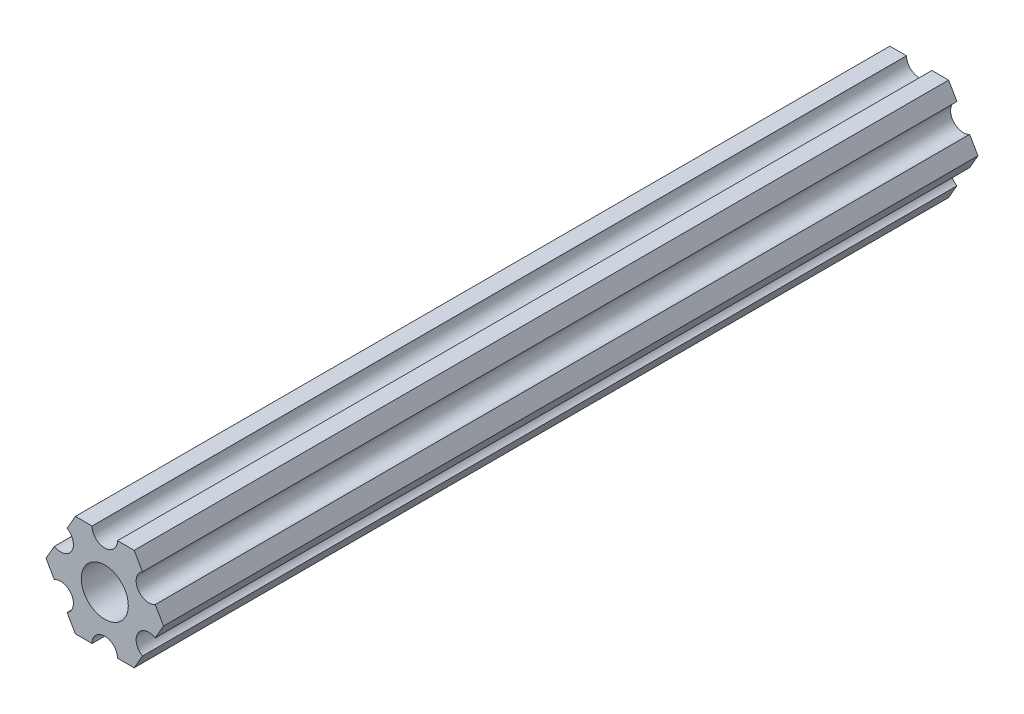
ISO-10303-21;
HEADER;
FILE_DESCRIPTION(('STEP AP214'),'2;1');
FILE_NAME('part.step','',(''),(''),'','','');
FILE_SCHEMA(('AUTOMOTIVE_DESIGN { 1 0 10303 214 1 1 1 1 }'));
ENDSEC;
DATA;
#1=APPLICATION_CONTEXT('core data for automotive mechanical design processes');
#2=APPLICATION_PROTOCOL_DEFINITION('international standard','automotive_design',2000,#1);
#3=PRODUCT_CONTEXT('',#1,'mechanical');
#4=PRODUCT('Part','Part','',(#3));
#5=PRODUCT_RELATED_PRODUCT_CATEGORY('part','',(#4));
#6=PRODUCT_DEFINITION_FORMATION('','',#4);
#7=PRODUCT_DEFINITION_CONTEXT('part definition',#1,'design');
#8=PRODUCT_DEFINITION('design','',#6,#7);
#9=PRODUCT_DEFINITION_SHAPE('','',#8);
#10=(LENGTH_UNIT() NAMED_UNIT(*) SI_UNIT(.MILLI.,.METRE.));
#11=(NAMED_UNIT(*) PLANE_ANGLE_UNIT() SI_UNIT($,.RADIAN.));
#12=(NAMED_UNIT(*) SI_UNIT($,.STERADIAN.) SOLID_ANGLE_UNIT());
#13=UNCERTAINTY_MEASURE_WITH_UNIT(LENGTH_MEASURE(1.E-05),#10,'distance_accuracy_value','');
#14=(GEOMETRIC_REPRESENTATION_CONTEXT(3) GLOBAL_UNCERTAINTY_ASSIGNED_CONTEXT((#13)) GLOBAL_UNIT_ASSIGNED_CONTEXT((#10,
#11,#12)) REPRESENTATION_CONTEXT('',''));
#15=CARTESIAN_POINT('',(0.,0.,0.));
#16=DIRECTION('',(0.,0.,1.));
#17=DIRECTION('',(1.,0.,0.));
#18=AXIS2_PLACEMENT_3D('',#15,#16,#17);
#19=CARTESIAN_POINT('',(5.49926112168156,3.17500033315933,101.6));
#20=DIRECTION('',(0.,0.,1.));
#21=DIRECTION('',(1.,0.,0.));
#22=AXIS2_PLACEMENT_3D('',#19,#20,#21);
#23=PLANE('',#22);
#24=DIRECTION('',(0.499999947533953,0.866025434075723,0.));
#25=VECTOR('',#24,1.);
#26=CARTESIAN_POINT('',(6.29301142309098,-1.80018429024546,101.6));
#27=LINE('',#26,#25);
#28=CARTESIAN_POINT('',(6.29301142309098,-1.80018429024546,101.6));
#29=VERTEX_POINT('',#28);
#30=CARTESIAN_POINT('',(7.33234841870826,4.44212519169686E-07,101.6));
#31=VERTEX_POINT('',#30);
#32=EDGE_CURVE('E227',#29,#31,#27,.T.);
#33=ORIENTED_EDGE('',*,*,#32,.T.);
#34=DIRECTION('',(-0.500000052466056,0.866025373493145,0.));
#35=VECTOR('',#34,1.);
#36=CARTESIAN_POINT('',(7.33234841870826,4.44212519169686E-07,101.6));
#37=LINE('',#36,#35);
#38=CARTESIAN_POINT('',(6.29301120497139,1.80018505273894,101.6));
#39=VERTEX_POINT('',#38);
#40=EDGE_CURVE('E125',#31,#39,#37,.T.);
#41=ORIENTED_EDGE('',*,*,#40,.T.);
#42=CARTESIAN_POINT('',(5.49926112168156,3.17500033315933,101.6));
#43=DIRECTION('',(0.,0.,-1.));
#44=DIRECTION('',(1.,0.,0.));
#45=AXIS2_PLACEMENT_3D('',#42,#43,#44);
#46=CIRCLE('',#45,1.5875);
#47=CARTESIAN_POINT('',(4.70551103839172,4.54981561357972,101.6));
#48=VERTEX_POINT('',#47);
#49=EDGE_CURVE('E272',#39,#48,#46,.T.);
#50=ORIENTED_EDGE('',*,*,#49,.T.);
#51=DIRECTION('',(-0.500000052466046,0.866025373493151,0.));
#52=VECTOR('',#51,1.);
#53=CARTESIAN_POINT('',(4.70551103839172,4.54981561357972,101.6));
#54=LINE('',#53,#52);
#55=CARTESIAN_POINT('',(3.66617382465481,6.35000022210627,101.6));
#56=VERTEX_POINT('',#55);
#57=EDGE_CURVE('E291',#48,#56,#54,.T.);
#58=ORIENTED_EDGE('',*,*,#57,.T.);
#59=DIRECTION('',(-0.999999999999998,-6.05825850611185E-08,0.));
#60=VECTOR('',#59,1.);
#61=CARTESIAN_POINT('',(3.66617382465481,6.35000022210627,101.6));
#62=LINE('',#61,#60);
#63=CARTESIAN_POINT('',(1.58749961530074,6.35000009617482,101.6));
#64=VERTEX_POINT('',#63);
#65=EDGE_CURVE('E288',#56,#64,#62,.T.);
#66=ORIENTED_EDGE('',*,*,#65,.T.);
#67=CARTESIAN_POINT('',(-3.84699260060323E-07,6.35,101.6));
#68=DIRECTION('',(0.,0.,-1.));
#69=DIRECTION('',(1.,0.,0.));
#70=AXIS2_PLACEMENT_3D('',#67,#68,#69);
#71=CIRCLE('',#70,1.5875);
#72=CARTESIAN_POINT('',(-1.58750038469926,6.34999990382518,101.6));
#73=VERTEX_POINT('',#72);
#74=EDGE_CURVE('E290',#64,#73,#71,.T.);
#75=ORIENTED_EDGE('',*,*,#74,.T.);
#76=DIRECTION('',(-0.999999999999998,-6.05825963273174E-08,0.));
#77=VECTOR('',#76,1.);
#78=CARTESIAN_POINT('',(-1.58750038469926,6.34999990382518,101.6));
#79=LINE('',#78,#77);
#80=CARTESIAN_POINT('',(-3.66617459405349,6.3499997778937,101.6));
#81=VERTEX_POINT('',#80);
#82=EDGE_CURVE('E293',#73,#81,#79,.T.);
#83=ORIENTED_EDGE('',*,*,#82,.T.);
#84=DIRECTION('',(-0.499999947533942,-0.866025434075729,0.));
#85=VECTOR('',#84,1.);
#86=CARTESIAN_POINT('',(-3.66617459405349,6.3499997778937,101.6));
#87=LINE('',#86,#85);
#88=CARTESIAN_POINT('',(-4.70551158967065,4.54981504343587,101.6));
#89=VERTEX_POINT('',#88);
#90=EDGE_CURVE('E299',#81,#89,#87,.T.);
#91=ORIENTED_EDGE('',*,*,#90,.T.);
#92=CARTESIAN_POINT('',(-5.49926150638082,3.17499966684067,101.6));
#93=DIRECTION('',(0.,0.,-1.));
#94=DIRECTION('',(1.,0.,0.));
#95=AXIS2_PLACEMENT_3D('',#92,#93,#94);
#96=CIRCLE('',#95,1.5875);
#97=CARTESIAN_POINT('',(-6.29301142309098,1.80018429024547,101.6));
#98=VERTEX_POINT('',#97);
#99=EDGE_CURVE('E301',#89,#98,#96,.T.);
#100=ORIENTED_EDGE('',*,*,#99,.T.);
#101=DIRECTION('',(-0.499999947533951,-0.866025434075724,0.));
#102=VECTOR('',#101,1.);
#103=CARTESIAN_POINT('',(-6.29301142309098,1.80018429024547,101.6));
#104=LINE('',#103,#102);
#105=CARTESIAN_POINT('',(-7.33234841870826,-4.44212523790841E-07,101.6));
#106=VERTEX_POINT('',#105);
#107=EDGE_CURVE('E303',#98,#106,#104,.T.);
#108=ORIENTED_EDGE('',*,*,#107,.T.);
#109=DIRECTION('',(0.500000052466045,-0.866025373493151,0.));
#110=VECTOR('',#109,1.);
#111=CARTESIAN_POINT('',(-7.33234841870826,-4.44212523790841E-07,101.6));
#112=LINE('',#111,#110);
#113=CARTESIAN_POINT('',(-6.29301120497141,-1.80018505273897,101.6));
#114=VERTEX_POINT('',#113);
#115=EDGE_CURVE('E305',#106,#114,#112,.T.);
#116=ORIENTED_EDGE('',*,*,#115,.T.);
#117=CARTESIAN_POINT('',(-5.49926112168156,-3.17500033315934,101.6));
#118=DIRECTION('',(0.,0.,-1.));
#119=DIRECTION('',(1.,0.,0.));
#120=AXIS2_PLACEMENT_3D('',#117,#118,#119);
#121=CIRCLE('',#120,1.5875);
#122=CARTESIAN_POINT('',(-4.70551103839172,-4.54981561357972,101.6));
#123=VERTEX_POINT('',#122);
#124=EDGE_CURVE('E307',#114,#123,#121,.T.);
#125=ORIENTED_EDGE('',*,*,#124,.T.);
#126=DIRECTION('',(0.500000052466045,-0.866025373493151,0.));
#127=VECTOR('',#126,1.);
#128=CARTESIAN_POINT('',(-4.70551103839172,-4.54981561357972,101.6));
#129=LINE('',#128,#127);
#130=CARTESIAN_POINT('',(-3.66617382465481,-6.35000022210628,101.6));
#131=VERTEX_POINT('',#130);
#132=EDGE_CURVE('E309',#123,#131,#129,.T.);
#133=ORIENTED_EDGE('',*,*,#132,.T.);
#134=DIRECTION('',(0.999999999999998,6.05825854783851E-08,0.));
#135=VECTOR('',#134,1.);
#136=CARTESIAN_POINT('',(-3.66617382465481,-6.35000022210628,101.6));
#137=LINE('',#136,#135);
#138=CARTESIAN_POINT('',(-1.58749961530074,-6.35000009617482,101.6));
#139=VERTEX_POINT('',#138);
#140=EDGE_CURVE('E311',#131,#139,#137,.T.);
#141=ORIENTED_EDGE('',*,*,#140,.T.);
#142=CARTESIAN_POINT('',(3.8469926204343E-07,-6.35,101.6));
#143=DIRECTION('',(0.,0.,-1.));
#144=DIRECTION('',(1.,0.,0.));
#145=AXIS2_PLACEMENT_3D('',#142,#143,#144);
#146=CIRCLE('',#145,1.5875);
#147=CARTESIAN_POINT('',(1.58750038469926,-6.34999990382518,101.6));
#148=VERTEX_POINT('',#147);
#149=EDGE_CURVE('E174',#139,#148,#146,.T.);
#150=ORIENTED_EDGE('',*,*,#149,.T.);
#151=DIRECTION('',(0.999999999999998,6.05825721258438E-08,0.));
#152=VECTOR('',#151,1.);
#153=CARTESIAN_POINT('',(1.58750038469926,-6.34999990382518,101.6));
#154=LINE('',#153,#152);
#155=CARTESIAN_POINT('',(3.66617459405346,-6.34999977789375,101.6));
#156=VERTEX_POINT('',#155);
#157=EDGE_CURVE('E168',#148,#156,#154,.T.);
#158=ORIENTED_EDGE('',*,*,#157,.T.);
#159=DIRECTION('',(0.499999947533941,0.86602543407573,0.));
#160=VECTOR('',#159,1.);
#161=CARTESIAN_POINT('',(3.66617459405346,-6.34999977789375,101.6));
#162=LINE('',#161,#160);
#163=CARTESIAN_POINT('',(4.70551158967065,-4.54981504343587,101.6));
#164=VERTEX_POINT('',#163);
#165=EDGE_CURVE('E172',#156,#164,#162,.T.);
#166=ORIENTED_EDGE('',*,*,#165,.T.);
#167=CARTESIAN_POINT('',(5.49926150638082,-3.17499966684067,101.6));
#168=DIRECTION('',(0.,0.,-1.));
#169=DIRECTION('',(1.,0.,0.));
#170=AXIS2_PLACEMENT_3D('',#167,#168,#169);
#171=CIRCLE('',#170,1.58750000000001);
#172=EDGE_CURVE('E52',#164,#29,#171,.T.);
#173=ORIENTED_EDGE('',*,*,#172,.T.);
#174=EDGE_LOOP('',(#33,#41,#50,#58,#66,#75,#83,#91,#100,#108,#116,#125,#133,#141,#150,#158,#166,#173));
#175=FACE_BOUND('',#174,.T.);
#176=CARTESIAN_POINT('',(0.,0.,101.6));
#177=DIRECTION('',(0.,0.,1.));
#178=DIRECTION('',(1.,0.,0.));
#179=AXIS2_PLACEMENT_3D('',#176,#177,#178);
#180=CIRCLE('',#179,2.9337);
#181=CARTESIAN_POINT('',(2.9337,0.,101.6));
#182=VERTEX_POINT('',#181);
#183=EDGE_CURVE('E196',#182,#182,#180,.T.);
#184=ORIENTED_EDGE('',*,*,#183,.F.);
#185=EDGE_LOOP('',(#184));
#186=FACE_BOUND('',#185,.T.);
#187=ADVANCED_FACE('F35',(#175,#186),#23,.T.);
#188=CARTESIAN_POINT('',(5.49926112168156,3.17500033315933,0.));
#189=DIRECTION('',(0.,0.,1.));
#190=DIRECTION('',(1.,0.,0.));
#191=AXIS2_PLACEMENT_3D('',#188,#189,#190);
#192=PLANE('',#191);
#193=DIRECTION('',(0.499999947533953,0.866025434075723,0.));
#194=VECTOR('',#193,1.);
#195=CARTESIAN_POINT('',(6.29301142309098,-1.80018429024546,0.));
#196=LINE('',#195,#194);
#197=CARTESIAN_POINT('',(6.29301142309098,-1.80018429024546,0.));
#198=VERTEX_POINT('',#197);
#199=CARTESIAN_POINT('',(7.33234841870826,4.44212519169686E-07,0.));
#200=VERTEX_POINT('',#199);
#201=EDGE_CURVE('E192',#198,#200,#196,.T.);
#202=ORIENTED_EDGE('',*,*,#201,.F.);
#203=CARTESIAN_POINT('',(5.49926150638082,-3.17499966684067,0.));
#204=DIRECTION('',(0.,0.,-1.));
#205=DIRECTION('',(1.,0.,0.));
#206=AXIS2_PLACEMENT_3D('',#203,#204,#205);
#207=CIRCLE('',#206,1.58750000000001);
#208=CARTESIAN_POINT('',(4.70551158967065,-4.54981504343587,0.));
#209=VERTEX_POINT('',#208);
#210=EDGE_CURVE('E117',#209,#198,#207,.T.);
#211=ORIENTED_EDGE('',*,*,#210,.F.);
#212=DIRECTION('',(0.499999947533941,0.86602543407573,0.));
#213=VECTOR('',#212,1.);
#214=CARTESIAN_POINT('',(3.66617459405346,-6.34999977789375,0.));
#215=LINE('',#214,#213);
#216=CARTESIAN_POINT('',(3.66617459405346,-6.34999977789375,0.));
#217=VERTEX_POINT('',#216);
#218=EDGE_CURVE('E111',#217,#209,#215,.T.);
#219=ORIENTED_EDGE('',*,*,#218,.F.);
#220=DIRECTION('',(0.999999999999998,6.05825721258438E-08,0.));
#221=VECTOR('',#220,1.);
#222=CARTESIAN_POINT('',(1.58750038469926,-6.34999990382518,0.));
#223=LINE('',#222,#221);
#224=CARTESIAN_POINT('',(1.58750038469926,-6.34999990382518,0.));
#225=VERTEX_POINT('',#224);
#226=EDGE_CURVE('E182',#225,#217,#223,.T.);
#227=ORIENTED_EDGE('',*,*,#226,.F.);
#228=CARTESIAN_POINT('',(3.8469926204343E-07,-6.35,0.));
#229=DIRECTION('',(0.,0.,-1.));
#230=DIRECTION('',(1.,0.,0.));
#231=AXIS2_PLACEMENT_3D('',#228,#229,#230);
#232=CIRCLE('',#231,1.5875);
#233=CARTESIAN_POINT('',(-1.58749961530074,-6.35000009617482,0.));
#234=VERTEX_POINT('',#233);
#235=EDGE_CURVE('E222',#234,#225,#232,.T.);
#236=ORIENTED_EDGE('',*,*,#235,.F.);
#237=DIRECTION('',(0.999999999999998,6.05825854783851E-08,0.));
#238=VECTOR('',#237,1.);
#239=CARTESIAN_POINT('',(-3.66617382465481,-6.35000022210628,0.));
#240=LINE('',#239,#238);
#241=CARTESIAN_POINT('',(-3.66617382465481,-6.35000022210628,0.));
#242=VERTEX_POINT('',#241);
#243=EDGE_CURVE('E220',#242,#234,#240,.T.);
#244=ORIENTED_EDGE('',*,*,#243,.F.);
#245=DIRECTION('',(0.500000052466045,-0.866025373493151,0.));
#246=VECTOR('',#245,1.);
#247=CARTESIAN_POINT('',(-4.70551103839172,-4.54981561357972,0.));
#248=LINE('',#247,#246);
#249=CARTESIAN_POINT('',(-4.70551103839172,-4.54981561357972,0.));
#250=VERTEX_POINT('',#249);
#251=EDGE_CURVE('E218',#250,#242,#248,.T.);
#252=ORIENTED_EDGE('',*,*,#251,.F.);
#253=CARTESIAN_POINT('',(-5.49926112168156,-3.17500033315934,0.));
#254=DIRECTION('',(0.,0.,-1.));
#255=DIRECTION('',(1.,0.,0.));
#256=AXIS2_PLACEMENT_3D('',#253,#254,#255);
#257=CIRCLE('',#256,1.5875);
#258=CARTESIAN_POINT('',(-6.29301120497141,-1.80018505273897,0.));
#259=VERTEX_POINT('',#258);
#260=EDGE_CURVE('E216',#259,#250,#257,.T.);
#261=ORIENTED_EDGE('',*,*,#260,.F.);
#262=DIRECTION('',(0.500000052466045,-0.866025373493151,0.));
#263=VECTOR('',#262,1.);
#264=CARTESIAN_POINT('',(-7.33234841870826,-4.44212523790841E-07,0.));
#265=LINE('',#264,#263);
#266=CARTESIAN_POINT('',(-7.33234841870826,-4.44212523790841E-07,0.));
#267=VERTEX_POINT('',#266);
#268=EDGE_CURVE('E214',#267,#259,#265,.T.);
#269=ORIENTED_EDGE('',*,*,#268,.F.);
#270=DIRECTION('',(-0.499999947533951,-0.866025434075724,0.));
#271=VECTOR('',#270,1.);
#272=CARTESIAN_POINT('',(-6.29301142309098,1.80018429024547,0.));
#273=LINE('',#272,#271);
#274=CARTESIAN_POINT('',(-6.29301142309098,1.80018429024547,0.));
#275=VERTEX_POINT('',#274);
#276=EDGE_CURVE('E212',#275,#267,#273,.T.);
#277=ORIENTED_EDGE('',*,*,#276,.F.);
#278=CARTESIAN_POINT('',(-5.49926150638082,3.17499966684067,0.));
#279=DIRECTION('',(0.,0.,-1.));
#280=DIRECTION('',(1.,0.,0.));
#281=AXIS2_PLACEMENT_3D('',#278,#279,#280);
#282=CIRCLE('',#281,1.5875);
#283=CARTESIAN_POINT('',(-4.70551158967065,4.54981504343587,0.));
#284=VERTEX_POINT('',#283);
#285=EDGE_CURVE('E210',#284,#275,#282,.T.);
#286=ORIENTED_EDGE('',*,*,#285,.F.);
#287=DIRECTION('',(-0.499999947533942,-0.866025434075729,0.));
#288=VECTOR('',#287,1.);
#289=CARTESIAN_POINT('',(-3.66617459405349,6.3499997778937,0.));
#290=LINE('',#289,#288);
#291=CARTESIAN_POINT('',(-3.66617459405349,6.3499997778937,0.));
#292=VERTEX_POINT('',#291);
#293=EDGE_CURVE('E208',#292,#284,#290,.T.);
#294=ORIENTED_EDGE('',*,*,#293,.F.);
#295=DIRECTION('',(-0.999999999999998,-6.05825963273174E-08,0.));
#296=VECTOR('',#295,1.);
#297=CARTESIAN_POINT('',(-1.58750038469926,6.34999990382518,0.));
#298=LINE('',#297,#296);
#299=CARTESIAN_POINT('',(-1.58750038469926,6.34999990382518,0.));
#300=VERTEX_POINT('',#299);
#301=EDGE_CURVE('E206',#300,#292,#298,.T.);
#302=ORIENTED_EDGE('',*,*,#301,.F.);
#303=CARTESIAN_POINT('',(-3.84699260060323E-07,6.35,0.));
#304=DIRECTION('',(0.,0.,-1.));
#305=DIRECTION('',(1.,0.,0.));
#306=AXIS2_PLACEMENT_3D('',#303,#304,#305);
#307=CIRCLE('',#306,1.5875);
#308=CARTESIAN_POINT('',(1.58749961530074,6.35000009617482,0.));
#309=VERTEX_POINT('',#308);
#310=EDGE_CURVE('E204',#309,#300,#307,.T.);
#311=ORIENTED_EDGE('',*,*,#310,.F.);
#312=DIRECTION('',(-0.999999999999998,-6.05825850611185E-08,0.));
#313=VECTOR('',#312,1.);
#314=CARTESIAN_POINT('',(3.66617382465481,6.35000022210627,0.));
#315=LINE('',#314,#313);
#316=CARTESIAN_POINT('',(3.66617382465481,6.35000022210627,0.));
#317=VERTEX_POINT('',#316);
#318=EDGE_CURVE('E202',#317,#309,#315,.T.);
#319=ORIENTED_EDGE('',*,*,#318,.F.);
#320=DIRECTION('',(-0.500000052466046,0.866025373493151,0.));
#321=VECTOR('',#320,1.);
#322=CARTESIAN_POINT('',(4.70551103839172,4.54981561357972,0.));
#323=LINE('',#322,#321);
#324=CARTESIAN_POINT('',(4.70551103839172,4.54981561357972,0.));
#325=VERTEX_POINT('',#324);
#326=EDGE_CURVE('E200',#325,#317,#323,.T.);
#327=ORIENTED_EDGE('',*,*,#326,.F.);
#328=CARTESIAN_POINT('',(5.49926112168156,3.17500033315933,0.));
#329=DIRECTION('',(0.,0.,-1.));
#330=DIRECTION('',(1.,0.,0.));
#331=AXIS2_PLACEMENT_3D('',#328,#329,#330);
#332=CIRCLE('',#331,1.5875);
#333=CARTESIAN_POINT('',(6.29301120497139,1.80018505273894,0.));
#334=VERTEX_POINT('',#333);
#335=EDGE_CURVE('E198',#334,#325,#332,.T.);
#336=ORIENTED_EDGE('',*,*,#335,.F.);
#337=DIRECTION('',(-0.500000052466056,0.866025373493145,0.));
#338=VECTOR('',#337,1.);
#339=CARTESIAN_POINT('',(7.33234841870826,4.44212519169686E-07,0.));
#340=LINE('',#339,#338);
#341=EDGE_CURVE('E195',#200,#334,#340,.T.);
#342=ORIENTED_EDGE('',*,*,#341,.F.);
#343=EDGE_LOOP('',(#202,#211,#219,#227,#236,#244,#252,#261,#269,#277,#286,#294,#302,#311,#319,
#327,#336,#342));
#344=FACE_BOUND('',#343,.T.);
#345=CARTESIAN_POINT('',(0.,0.,0.));
#346=DIRECTION('',(0.,0.,1.));
#347=DIRECTION('',(1.,0.,0.));
#348=AXIS2_PLACEMENT_3D('',#345,#346,#347);
#349=CIRCLE('',#348,2.9337);
#350=CARTESIAN_POINT('',(2.9337,0.,0.));
#351=VERTEX_POINT('',#350);
#352=EDGE_CURVE('E536',#351,#351,#349,.T.);
#353=ORIENTED_EDGE('',*,*,#352,.T.);
#354=EDGE_LOOP('',(#353));
#355=FACE_BOUND('',#354,.T.);
#356=ADVANCED_FACE('F276',(#344,#355),#192,.F.);
#357=CARTESIAN_POINT('',(6.29301142309098,-1.80018429024546,101.6));
#358=DIRECTION('',(-0.866025434075723,0.499999947533953,0.));
#359=DIRECTION('',(-0.499999947533953,-0.866025434075723,0.));
#360=AXIS2_PLACEMENT_3D('',#357,#358,#359);
#361=PLANE('',#360);
#362=ORIENTED_EDGE('',*,*,#201,.T.);
#363=DIRECTION('',(0.,0.,-1.));
#364=VECTOR('',#363,1.);
#365=CARTESIAN_POINT('',(7.33234841870826,4.44212519169686E-07,101.6));
#366=LINE('',#365,#364);
#367=EDGE_CURVE('E11',#31,#200,#366,.T.);
#368=ORIENTED_EDGE('',*,*,#367,.F.);
#369=ORIENTED_EDGE('',*,*,#32,.F.);
#370=DIRECTION('',(0.,0.,-1.));
#371=VECTOR('',#370,1.);
#372=CARTESIAN_POINT('',(6.29301142309098,-1.80018429024546,101.6));
#373=LINE('',#372,#371);
#374=EDGE_CURVE('E188',#29,#198,#373,.T.);
#375=ORIENTED_EDGE('',*,*,#374,.T.);
#376=EDGE_LOOP('',(#362,#368,#369,#375));
#377=FACE_BOUND('',#376,.T.);
#378=ADVANCED_FACE('F37',(#377),#361,.F.);
#379=CARTESIAN_POINT('',(7.33234841870826,4.44212519169686E-07,101.6));
#380=DIRECTION('',(-0.866025373493145,-0.500000052466056,0.));
#381=DIRECTION('',(0.500000052466056,-0.866025373493145,0.));
#382=AXIS2_PLACEMENT_3D('',#379,#380,#381);
#383=PLANE('',#382);
#384=ORIENTED_EDGE('',*,*,#341,.T.);
#385=DIRECTION('',(0.,0.,-1.));
#386=VECTOR('',#385,1.);
#387=CARTESIAN_POINT('',(6.29301120497139,1.80018505273894,101.6));
#388=LINE('',#387,#386);
#389=EDGE_CURVE('E44',#39,#334,#388,.T.);
#390=ORIENTED_EDGE('',*,*,#389,.F.);
#391=ORIENTED_EDGE('',*,*,#40,.F.);
#392=ORIENTED_EDGE('',*,*,#367,.T.);
#393=EDGE_LOOP('',(#384,#390,#391,#392));
#394=FACE_BOUND('',#393,.T.);
#395=ADVANCED_FACE('F345',(#394),#383,.F.);
#396=CARTESIAN_POINT('',(5.49926112168156,3.17500033315933,101.6));
#397=DIRECTION('',(0.,0.,-1.));
#398=DIRECTION('',(-1.,0.,0.));
#399=AXIS2_PLACEMENT_3D('',#396,#397,#398);
#400=CYLINDRICAL_SURFACE('',#399,1.5875);
#401=ORIENTED_EDGE('',*,*,#335,.T.);
#402=DIRECTION('',(0.,0.,-1.));
#403=VECTOR('',#402,1.);
#404=CARTESIAN_POINT('',(4.70551103839172,4.54981561357972,101.6));
#405=LINE('',#404,#403);
#406=EDGE_CURVE('E264',#48,#325,#405,.T.);
#407=ORIENTED_EDGE('',*,*,#406,.F.);
#408=ORIENTED_EDGE('',*,*,#49,.F.);
#409=ORIENTED_EDGE('',*,*,#389,.T.);
#410=EDGE_LOOP('',(#401,#407,#408,#409));
#411=FACE_BOUND('',#410,.T.);
#412=ADVANCED_FACE('F270',(#411),#400,.F.);
#413=CARTESIAN_POINT('',(4.70551103839172,4.54981561357972,101.6));
#414=DIRECTION('',(-0.866025373493151,-0.500000052466046,0.));
#415=DIRECTION('',(0.500000052466046,-0.866025373493151,0.));
#416=AXIS2_PLACEMENT_3D('',#413,#414,#415);
#417=PLANE('',#416);
#418=ORIENTED_EDGE('',*,*,#326,.T.);
#419=DIRECTION('',(0.,0.,-1.));
#420=VECTOR('',#419,1.);
#421=CARTESIAN_POINT('',(3.66617382465481,6.35000022210627,101.6));
#422=LINE('',#421,#420);
#423=EDGE_CURVE('E261',#56,#317,#422,.T.);
#424=ORIENTED_EDGE('',*,*,#423,.F.);
#425=ORIENTED_EDGE('',*,*,#57,.F.);
#426=ORIENTED_EDGE('',*,*,#406,.T.);
#427=EDGE_LOOP('',(#418,#424,#425,#426));
#428=FACE_BOUND('',#427,.T.);
#429=ADVANCED_FACE('F282',(#428),#417,.F.);
#430=CARTESIAN_POINT('',(3.66617382465481,6.35000022210627,101.6));
#431=DIRECTION('',(6.05825850611185E-08,-0.999999999999998,0.));
#432=DIRECTION('',(0.999999999999998,6.05825850611185E-08,0.));
#433=AXIS2_PLACEMENT_3D('',#430,#431,#432);
#434=PLANE('',#433);
#435=ORIENTED_EDGE('',*,*,#318,.T.);
#436=DIRECTION('',(0.,0.,-1.));
#437=VECTOR('',#436,1.);
#438=CARTESIAN_POINT('',(1.58749961530074,6.35000009617482,101.6));
#439=LINE('',#438,#437);
#440=EDGE_CURVE('E258',#64,#309,#439,.T.);
#441=ORIENTED_EDGE('',*,*,#440,.F.);
#442=ORIENTED_EDGE('',*,*,#65,.F.);
#443=ORIENTED_EDGE('',*,*,#423,.T.);
#444=EDGE_LOOP('',(#435,#441,#442,#443));
#445=FACE_BOUND('',#444,.T.);
#446=ADVANCED_FACE('F286',(#445),#434,.F.);
#447=CARTESIAN_POINT('',(-3.84699260060323E-07,6.35,101.6));
#448=DIRECTION('',(0.,0.,-1.));
#449=DIRECTION('',(-1.,0.,0.));
#450=AXIS2_PLACEMENT_3D('',#447,#448,#449);
#451=CYLINDRICAL_SURFACE('',#450,1.5875);
#452=ORIENTED_EDGE('',*,*,#310,.T.);
#453=DIRECTION('',(0.,0.,-1.));
#454=VECTOR('',#453,1.);
#455=CARTESIAN_POINT('',(-1.58750038469926,6.34999990382518,101.6));
#456=LINE('',#455,#454);
#457=EDGE_CURVE('E255',#73,#300,#456,.T.);
#458=ORIENTED_EDGE('',*,*,#457,.F.);
#459=ORIENTED_EDGE('',*,*,#74,.F.);
#460=ORIENTED_EDGE('',*,*,#440,.T.);
#461=EDGE_LOOP('',(#452,#458,#459,#460));
#462=FACE_BOUND('',#461,.T.);
#463=ADVANCED_FACE('F358',(#462),#451,.F.);
#464=CARTESIAN_POINT('',(-1.58750038469926,6.34999990382518,101.6));
#465=DIRECTION('',(6.05825963273174E-08,-0.999999999999998,0.));
#466=DIRECTION('',(0.999999999999998,6.05825963273174E-08,0.));
#467=AXIS2_PLACEMENT_3D('',#464,#465,#466);
#468=PLANE('',#467);
#469=ORIENTED_EDGE('',*,*,#301,.T.);
#470=DIRECTION('',(0.,0.,-1.));
#471=VECTOR('',#470,1.);
#472=CARTESIAN_POINT('',(-3.66617459405349,6.3499997778937,101.6));
#473=LINE('',#472,#471);
#474=EDGE_CURVE('E252',#81,#292,#473,.T.);
#475=ORIENTED_EDGE('',*,*,#474,.F.);
#476=ORIENTED_EDGE('',*,*,#82,.F.);
#477=ORIENTED_EDGE('',*,*,#457,.T.);
#478=EDGE_LOOP('',(#469,#475,#476,#477));
#479=FACE_BOUND('',#478,.T.);
#480=ADVANCED_FACE('F361',(#479),#468,.F.);
#481=CARTESIAN_POINT('',(-3.66617459405349,6.3499997778937,101.6));
#482=DIRECTION('',(0.866025434075729,-0.499999947533942,0.));
#483=DIRECTION('',(0.499999947533943,0.866025434075729,0.));
#484=AXIS2_PLACEMENT_3D('',#481,#482,#483);
#485=PLANE('',#484);
#486=ORIENTED_EDGE('',*,*,#293,.T.);
#487=DIRECTION('',(0.,0.,-1.));
#488=VECTOR('',#487,1.);
#489=CARTESIAN_POINT('',(-4.70551158967065,4.54981504343587,101.6));
#490=LINE('',#489,#488);
#491=EDGE_CURVE('E249',#89,#284,#490,.T.);
#492=ORIENTED_EDGE('',*,*,#491,.F.);
#493=ORIENTED_EDGE('',*,*,#90,.F.);
#494=ORIENTED_EDGE('',*,*,#474,.T.);
#495=EDGE_LOOP('',(#486,#492,#493,#494));
#496=FACE_BOUND('',#495,.T.);
#497=ADVANCED_FACE('F365',(#496),#485,.F.);
#498=CARTESIAN_POINT('',(-5.49926150638082,3.17499966684067,101.6));
#499=DIRECTION('',(0.,0.,-1.));
#500=DIRECTION('',(-1.,0.,0.));
#501=AXIS2_PLACEMENT_3D('',#498,#499,#500);
#502=CYLINDRICAL_SURFACE('',#501,1.5875);
#503=ORIENTED_EDGE('',*,*,#285,.T.);
#504=DIRECTION('',(0.,0.,-1.));
#505=VECTOR('',#504,1.);
#506=CARTESIAN_POINT('',(-6.29301142309098,1.80018429024547,101.6));
#507=LINE('',#506,#505);
#508=EDGE_CURVE('E246',#98,#275,#507,.T.);
#509=ORIENTED_EDGE('',*,*,#508,.F.);
#510=ORIENTED_EDGE('',*,*,#99,.F.);
#511=ORIENTED_EDGE('',*,*,#491,.T.);
#512=EDGE_LOOP('',(#503,#509,#510,#511));
#513=FACE_BOUND('',#512,.T.);
#514=ADVANCED_FACE('F369',(#513),#502,.F.);
#515=CARTESIAN_POINT('',(-6.29301142309098,1.80018429024547,101.6));
#516=DIRECTION('',(0.866025434075724,-0.499999947533951,0.));
#517=DIRECTION('',(0.499999947533951,0.866025434075724,0.));
#518=AXIS2_PLACEMENT_3D('',#515,#516,#517);
#519=PLANE('',#518);
#520=ORIENTED_EDGE('',*,*,#276,.T.);
#521=DIRECTION('',(0.,0.,-1.));
#522=VECTOR('',#521,1.);
#523=CARTESIAN_POINT('',(-7.33234841870826,-4.44212523790841E-07,101.6));
#524=LINE('',#523,#522);
#525=EDGE_CURVE('E243',#106,#267,#524,.T.);
#526=ORIENTED_EDGE('',*,*,#525,.F.);
#527=ORIENTED_EDGE('',*,*,#107,.F.);
#528=ORIENTED_EDGE('',*,*,#508,.T.);
#529=EDGE_LOOP('',(#520,#526,#527,#528));
#530=FACE_BOUND('',#529,.T.);
#531=ADVANCED_FACE('F373',(#530),#519,.F.);
#532=CARTESIAN_POINT('',(-7.33234841870826,-4.44212523790841E-07,101.6));
#533=DIRECTION('',(0.866025373493151,0.500000052466045,0.));
#534=DIRECTION('',(-0.500000052466045,0.866025373493151,0.));
#535=AXIS2_PLACEMENT_3D('',#532,#533,#534);
#536=PLANE('',#535);
#537=ORIENTED_EDGE('',*,*,#268,.T.);
#538=DIRECTION('',(0.,0.,-1.));
#539=VECTOR('',#538,1.);
#540=CARTESIAN_POINT('',(-6.29301120497141,-1.80018505273897,101.6));
#541=LINE('',#540,#539);
#542=EDGE_CURVE('E240',#114,#259,#541,.T.);
#543=ORIENTED_EDGE('',*,*,#542,.F.);
#544=ORIENTED_EDGE('',*,*,#115,.F.);
#545=ORIENTED_EDGE('',*,*,#525,.T.);
#546=EDGE_LOOP('',(#537,#543,#544,#545));
#547=FACE_BOUND('',#546,.T.);
#548=ADVANCED_FACE('F377',(#547),#536,.F.);
#549=CARTESIAN_POINT('',(-5.49926112168156,-3.17500033315934,101.6));
#550=DIRECTION('',(0.,0.,-1.));
#551=DIRECTION('',(-1.,0.,0.));
#552=AXIS2_PLACEMENT_3D('',#549,#550,#551);
#553=CYLINDRICAL_SURFACE('',#552,1.5875);
#554=ORIENTED_EDGE('',*,*,#260,.T.);
#555=DIRECTION('',(0.,0.,-1.));
#556=VECTOR('',#555,1.);
#557=CARTESIAN_POINT('',(-4.70551103839172,-4.54981561357972,101.6));
#558=LINE('',#557,#556);
#559=EDGE_CURVE('E237',#123,#250,#558,.T.);
#560=ORIENTED_EDGE('',*,*,#559,.F.);
#561=ORIENTED_EDGE('',*,*,#124,.F.);
#562=ORIENTED_EDGE('',*,*,#542,.T.);
#563=EDGE_LOOP('',(#554,#560,#561,#562));
#564=FACE_BOUND('',#563,.T.);
#565=ADVANCED_FACE('F381',(#564),#553,.F.);
#566=CARTESIAN_POINT('',(-4.70551103839172,-4.54981561357972,101.6));
#567=DIRECTION('',(0.866025373493151,0.500000052466045,0.));
#568=DIRECTION('',(-0.500000052466045,0.866025373493151,0.));
#569=AXIS2_PLACEMENT_3D('',#566,#567,#568);
#570=PLANE('',#569);
#571=ORIENTED_EDGE('',*,*,#251,.T.);
#572=DIRECTION('',(0.,0.,-1.));
#573=VECTOR('',#572,1.);
#574=CARTESIAN_POINT('',(-3.66617382465481,-6.35000022210628,101.6));
#575=LINE('',#574,#573);
#576=EDGE_CURVE('E234',#131,#242,#575,.T.);
#577=ORIENTED_EDGE('',*,*,#576,.F.);
#578=ORIENTED_EDGE('',*,*,#132,.F.);
#579=ORIENTED_EDGE('',*,*,#559,.T.);
#580=EDGE_LOOP('',(#571,#577,#578,#579));
#581=FACE_BOUND('',#580,.T.);
#582=ADVANCED_FACE('F385',(#581),#570,.F.);
#583=CARTESIAN_POINT('',(-3.66617382465481,-6.35000022210628,101.6));
#584=DIRECTION('',(-6.05825854783851E-08,0.999999999999998,0.));
#585=DIRECTION('',(-0.999999999999998,-6.05825854783851E-08,0.));
#586=AXIS2_PLACEMENT_3D('',#583,#584,#585);
#587=PLANE('',#586);
#588=ORIENTED_EDGE('',*,*,#243,.T.);
#589=DIRECTION('',(0.,0.,-1.));
#590=VECTOR('',#589,1.);
#591=CARTESIAN_POINT('',(-1.58749961530074,-6.35000009617482,101.6));
#592=LINE('',#591,#590);
#593=EDGE_CURVE('E231',#139,#234,#592,.T.);
#594=ORIENTED_EDGE('',*,*,#593,.F.);
#595=ORIENTED_EDGE('',*,*,#140,.F.);
#596=ORIENTED_EDGE('',*,*,#576,.T.);
#597=EDGE_LOOP('',(#588,#594,#595,#596));
#598=FACE_BOUND('',#597,.T.);
#599=ADVANCED_FACE('F317',(#598),#587,.F.);
#600=CARTESIAN_POINT('',(3.8469926204343E-07,-6.35,101.6));
#601=DIRECTION('',(0.,0.,-1.));
#602=DIRECTION('',(-1.,0.,0.));
#603=AXIS2_PLACEMENT_3D('',#600,#601,#602);
#604=CYLINDRICAL_SURFACE('',#603,1.5875);
#605=ORIENTED_EDGE('',*,*,#235,.T.);
#606=DIRECTION('',(0.,0.,-1.));
#607=VECTOR('',#606,1.);
#608=CARTESIAN_POINT('',(1.58750038469926,-6.34999990382518,101.6));
#609=LINE('',#608,#607);
#610=EDGE_CURVE('E183',#148,#225,#609,.T.);
#611=ORIENTED_EDGE('',*,*,#610,.F.);
#612=ORIENTED_EDGE('',*,*,#149,.F.);
#613=ORIENTED_EDGE('',*,*,#593,.T.);
#614=EDGE_LOOP('',(#605,#611,#612,#613));
#615=FACE_BOUND('',#614,.T.);
#616=ADVANCED_FACE('F321',(#615),#604,.F.);
#617=CARTESIAN_POINT('',(1.58750038469926,-6.34999990382518,101.6));
#618=DIRECTION('',(-6.05825721258438E-08,0.999999999999998,0.));
#619=DIRECTION('',(-0.999999999999998,-6.05825721258438E-08,0.));
#620=AXIS2_PLACEMENT_3D('',#617,#618,#619);
#621=PLANE('',#620);
#622=ORIENTED_EDGE('',*,*,#226,.T.);
#623=DIRECTION('',(0.,0.,-1.));
#624=VECTOR('',#623,1.);
#625=CARTESIAN_POINT('',(3.66617459405346,-6.34999977789375,101.6));
#626=LINE('',#625,#624);
#627=EDGE_CURVE('E179',#156,#217,#626,.T.);
#628=ORIENTED_EDGE('',*,*,#627,.F.);
#629=ORIENTED_EDGE('',*,*,#157,.F.);
#630=ORIENTED_EDGE('',*,*,#610,.T.);
#631=EDGE_LOOP('',(#622,#628,#629,#630));
#632=FACE_BOUND('',#631,.T.);
#633=ADVANCED_FACE('F180',(#632),#621,.F.);
#634=CARTESIAN_POINT('',(3.66617459405346,-6.34999977789375,101.6));
#635=DIRECTION('',(-0.86602543407573,0.499999947533941,0.));
#636=DIRECTION('',(-0.499999947533941,-0.86602543407573,0.));
#637=AXIS2_PLACEMENT_3D('',#634,#635,#636);
#638=PLANE('',#637);
#639=ORIENTED_EDGE('',*,*,#218,.T.);
#640=DIRECTION('',(0.,0.,-1.));
#641=VECTOR('',#640,1.);
#642=CARTESIAN_POINT('',(4.70551158967065,-4.54981504343587,101.6));
#643=LINE('',#642,#641);
#644=EDGE_CURVE('E184',#164,#209,#643,.T.);
#645=ORIENTED_EDGE('',*,*,#644,.F.);
#646=ORIENTED_EDGE('',*,*,#165,.F.);
#647=ORIENTED_EDGE('',*,*,#627,.T.);
#648=EDGE_LOOP('',(#639,#645,#646,#647));
#649=FACE_BOUND('',#648,.T.);
#650=ADVANCED_FACE('F186',(#649),#638,.F.);
#651=CARTESIAN_POINT('',(5.49926150638082,-3.17499966684067,101.6));
#652=DIRECTION('',(0.,0.,-1.));
#653=DIRECTION('',(-1.,0.,0.));
#654=AXIS2_PLACEMENT_3D('',#651,#652,#653);
#655=CYLINDRICAL_SURFACE('',#654,1.58750000000001);
#656=ORIENTED_EDGE('',*,*,#210,.T.);
#657=ORIENTED_EDGE('',*,*,#374,.F.);
#658=ORIENTED_EDGE('',*,*,#172,.F.);
#659=ORIENTED_EDGE('',*,*,#644,.T.);
#660=EDGE_LOOP('',(#656,#657,#658,#659));
#661=FACE_BOUND('',#660,.T.);
#662=ADVANCED_FACE('F325',(#661),#655,.F.);
#663=CARTESIAN_POINT('',(0.,0.,101.6));
#664=DIRECTION('',(0.,0.,-1.));
#665=DIRECTION('',(-1.,0.,0.));
#666=AXIS2_PLACEMENT_3D('',#663,#664,#665);
#667=CYLINDRICAL_SURFACE('',#666,2.9337);
#668=ORIENTED_EDGE('',*,*,#183,.T.);
#669=EDGE_LOOP('',(#668));
#670=FACE_BOUND('',#669,.T.);
#671=ORIENTED_EDGE('',*,*,#352,.F.);
#672=EDGE_LOOP('',(#671));
#673=FACE_BOUND('',#672,.T.);
#674=ADVANCED_FACE('F327',(#670,#673),#667,.F.);
#675=CLOSED_SHELL('',(#187,#356,#378,#395,#412,#429,#446,#463,#480,#497,#514,#531,#548,#565,
#582,#599,#616,#633,#650,#662,#674));
#676=MANIFOLD_SOLID_BREP('B2',#675);
#677=ADVANCED_BREP_SHAPE_REPRESENTATION('',(#18,#676),#14);
#678=SHAPE_DEFINITION_REPRESENTATION(#9,#677);
ENDSEC;
END-ISO-10303-21;
